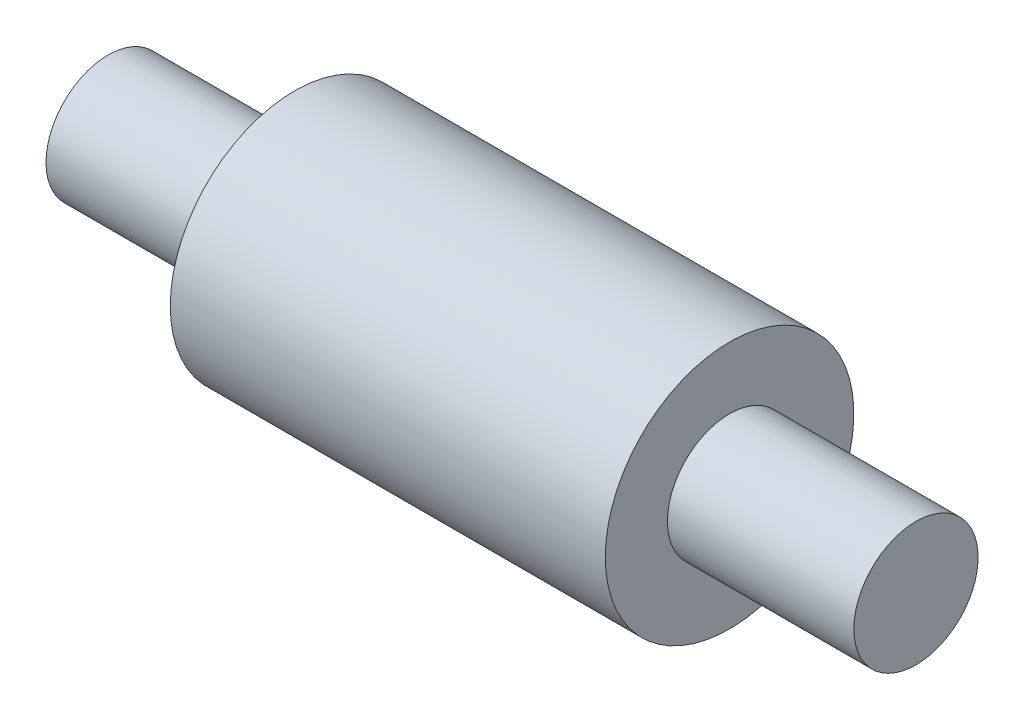
ISO-10303-21;
HEADER;
FILE_DESCRIPTION(('STEP AP214'),'2;1');
FILE_NAME('part.step','',(''),(''),'','','');
FILE_SCHEMA(('AUTOMOTIVE_DESIGN { 1 0 10303 214 1 1 1 1 }'));
ENDSEC;
DATA;
#1=APPLICATION_CONTEXT('core data for automotive mechanical design processes');
#2=APPLICATION_PROTOCOL_DEFINITION('international standard','automotive_design',2000,#1);
#3=PRODUCT_CONTEXT('',#1,'mechanical');
#4=PRODUCT('Part','Part','',(#3));
#5=PRODUCT_RELATED_PRODUCT_CATEGORY('part','',(#4));
#6=PRODUCT_DEFINITION_FORMATION('','',#4);
#7=PRODUCT_DEFINITION_CONTEXT('part definition',#1,'design');
#8=PRODUCT_DEFINITION('design','',#6,#7);
#9=PRODUCT_DEFINITION_SHAPE('','',#8);
#10=(LENGTH_UNIT() NAMED_UNIT(*) SI_UNIT(.MILLI.,.METRE.));
#11=(NAMED_UNIT(*) PLANE_ANGLE_UNIT() SI_UNIT($,.RADIAN.));
#12=(NAMED_UNIT(*) SI_UNIT($,.STERADIAN.) SOLID_ANGLE_UNIT());
#13=UNCERTAINTY_MEASURE_WITH_UNIT(LENGTH_MEASURE(1.E-05),#10,'distance_accuracy_value','');
#14=(GEOMETRIC_REPRESENTATION_CONTEXT(3) GLOBAL_UNCERTAINTY_ASSIGNED_CONTEXT((#13)) GLOBAL_UNIT_ASSIGNED_CONTEXT((#10,
#11,#12)) REPRESENTATION_CONTEXT('',''));
#15=CARTESIAN_POINT('',(0.,0.,0.));
#16=DIRECTION('',(0.,0.,1.));
#17=DIRECTION('',(1.,0.,0.));
#18=AXIS2_PLACEMENT_3D('',#15,#16,#17);
#19=CARTESIAN_POINT('',(30.,10.,0.));
#20=DIRECTION('',(1.,0.,0.));
#21=DIRECTION('',(0.,0.,-1.));
#22=AXIS2_PLACEMENT_3D('',#19,#20,#21);
#23=PLANE('',#22);
#24=CARTESIAN_POINT('',(30.,0.,0.));
#25=DIRECTION('',(-1.,0.,0.));
#26=DIRECTION('',(0.,0.,1.));
#27=AXIS2_PLACEMENT_3D('',#24,#25,#26);
#28=CIRCLE('',#27,10.);
#29=CARTESIAN_POINT('',(30.,0.,10.));
#30=VERTEX_POINT('',#29);
#31=EDGE_CURVE('E53',#30,#30,#28,.T.);
#32=ORIENTED_EDGE('',*,*,#31,.F.);
#33=EDGE_LOOP('',(#32));
#34=FACE_BOUND('',#33,.T.);
#35=CARTESIAN_POINT('',(30.,0.,0.));
#36=DIRECTION('',(-1.,0.,0.));
#37=DIRECTION('',(0.,0.,1.));
#38=AXIS2_PLACEMENT_3D('',#35,#36,#37);
#39=CIRCLE('',#38,20.);
#40=CARTESIAN_POINT('',(30.,0.,20.));
#41=VERTEX_POINT('',#40);
#42=EDGE_CURVE('E10',#41,#41,#39,.T.);
#43=ORIENTED_EDGE('',*,*,#42,.T.);
#44=EDGE_LOOP('',(#43));
#45=FACE_BOUND('',#44,.T.);
#46=ADVANCED_FACE('F31',(#34,#45),#23,.F.);
#47=CARTESIAN_POINT('',(-58.4182482549179,0.,0.));
#48=DIRECTION('',(-1.,0.,0.));
#49=DIRECTION('',(0.,0.,1.));
#50=AXIS2_PLACEMENT_3D('',#47,#48,#49);
#51=CYLINDRICAL_SURFACE('',#50,20.);
#52=ORIENTED_EDGE('',*,*,#42,.F.);
#53=EDGE_LOOP('',(#52));
#54=FACE_BOUND('',#53,.T.);
#55=CARTESIAN_POINT('',(100.,0.,0.));
#56=DIRECTION('',(-1.,0.,0.));
#57=DIRECTION('',(0.,0.,1.));
#58=AXIS2_PLACEMENT_3D('',#55,#56,#57);
#59=CIRCLE('',#58,20.);
#60=CARTESIAN_POINT('',(100.,0.,20.));
#61=VERTEX_POINT('',#60);
#62=EDGE_CURVE('E37',#61,#61,#59,.T.);
#63=ORIENTED_EDGE('',*,*,#62,.T.);
#64=EDGE_LOOP('',(#63));
#65=FACE_BOUND('',#64,.T.);
#66=ADVANCED_FACE('F60',(#54,#65),#51,.T.);
#67=CARTESIAN_POINT('',(100.,20.,0.));
#68=DIRECTION('',(-1.,0.,0.));
#69=DIRECTION('',(0.,0.,1.));
#70=AXIS2_PLACEMENT_3D('',#67,#68,#69);
#71=PLANE('',#70);
#72=ORIENTED_EDGE('',*,*,#62,.F.);
#73=EDGE_LOOP('',(#72));
#74=FACE_BOUND('',#73,.T.);
#75=CARTESIAN_POINT('',(100.,0.,0.));
#76=DIRECTION('',(-1.,0.,0.));
#77=DIRECTION('',(0.,0.,1.));
#78=AXIS2_PLACEMENT_3D('',#75,#76,#77);
#79=CIRCLE('',#78,10.);
#80=CARTESIAN_POINT('',(100.,0.,10.));
#81=VERTEX_POINT('',#80);
#82=EDGE_CURVE('E41',#81,#81,#79,.T.);
#83=ORIENTED_EDGE('',*,*,#82,.T.);
#84=EDGE_LOOP('',(#83));
#85=FACE_BOUND('',#84,.T.);
#86=ADVANCED_FACE('F64',(#74,#85),#71,.F.);
#87=CARTESIAN_POINT('',(-58.4182482549179,0.,0.));
#88=DIRECTION('',(-1.,0.,0.));
#89=DIRECTION('',(0.,0.,1.));
#90=AXIS2_PLACEMENT_3D('',#87,#88,#89);
#91=CYLINDRICAL_SURFACE('',#90,10.);
#92=ORIENTED_EDGE('',*,*,#82,.F.);
#93=EDGE_LOOP('',(#92));
#94=FACE_BOUND('',#93,.T.);
#95=CARTESIAN_POINT('',(130.,0.,0.));
#96=DIRECTION('',(-1.,0.,0.));
#97=DIRECTION('',(0.,0.,1.));
#98=AXIS2_PLACEMENT_3D('',#95,#96,#97);
#99=CIRCLE('',#98,10.);
#100=CARTESIAN_POINT('',(130.,0.,10.));
#101=VERTEX_POINT('',#100);
#102=EDGE_CURVE('E45',#101,#101,#99,.T.);
#103=ORIENTED_EDGE('',*,*,#102,.T.);
#104=EDGE_LOOP('',(#103));
#105=FACE_BOUND('',#104,.T.);
#106=ADVANCED_FACE('F69',(#94,#105),#91,.T.);
#107=CARTESIAN_POINT('',(130.,10.,0.));
#108=DIRECTION('',(-1.,0.,0.));
#109=DIRECTION('',(0.,0.,1.));
#110=AXIS2_PLACEMENT_3D('',#107,#108,#109);
#111=PLANE('',#110);
#112=ORIENTED_EDGE('',*,*,#102,.F.);
#113=EDGE_LOOP('',(#112));
#114=FACE_BOUND('',#113,.T.);
#115=ADVANCED_FACE('F75',(#114),#111,.F.);
#116=CARTESIAN_POINT('',(0.,0.,0.));
#117=DIRECTION('',(1.,0.,0.));
#118=DIRECTION('',(0.,0.,-1.));
#119=AXIS2_PLACEMENT_3D('',#116,#117,#118);
#120=PLANE('',#119);
#121=CARTESIAN_POINT('',(0.,0.,0.));
#122=DIRECTION('',(-1.,0.,0.));
#123=DIRECTION('',(0.,0.,1.));
#124=AXIS2_PLACEMENT_3D('',#121,#122,#123);
#125=CIRCLE('',#124,10.);
#126=CARTESIAN_POINT('',(0.,0.,10.));
#127=VERTEX_POINT('',#126);
#128=EDGE_CURVE('E50',#127,#127,#125,.T.);
#129=ORIENTED_EDGE('',*,*,#128,.T.);
#130=EDGE_LOOP('',(#129));
#131=FACE_BOUND('',#130,.T.);
#132=ADVANCED_FACE('F79',(#131),#120,.F.);
#133=CARTESIAN_POINT('',(-58.4182482549179,0.,0.));
#134=DIRECTION('',(-1.,0.,0.));
#135=DIRECTION('',(0.,0.,1.));
#136=AXIS2_PLACEMENT_3D('',#133,#134,#135);
#137=CYLINDRICAL_SURFACE('',#136,10.);
#138=ORIENTED_EDGE('',*,*,#128,.F.);
#139=EDGE_LOOP('',(#138));
#140=FACE_BOUND('',#139,.T.);
#141=ORIENTED_EDGE('',*,*,#31,.T.);
#142=EDGE_LOOP('',(#141));
#143=FACE_BOUND('',#142,.T.);
#144=ADVANCED_FACE('F57',(#140,#143),#137,.T.);
#145=CLOSED_SHELL('',(#46,#66,#86,#106,#115,#132,#144));
#146=MANIFOLD_SOLID_BREP('B2',#145);
#147=ADVANCED_BREP_SHAPE_REPRESENTATION('',(#18,#146),#14);
#148=SHAPE_DEFINITION_REPRESENTATION(#9,#147);
ENDSEC;
END-ISO-10303-21;
